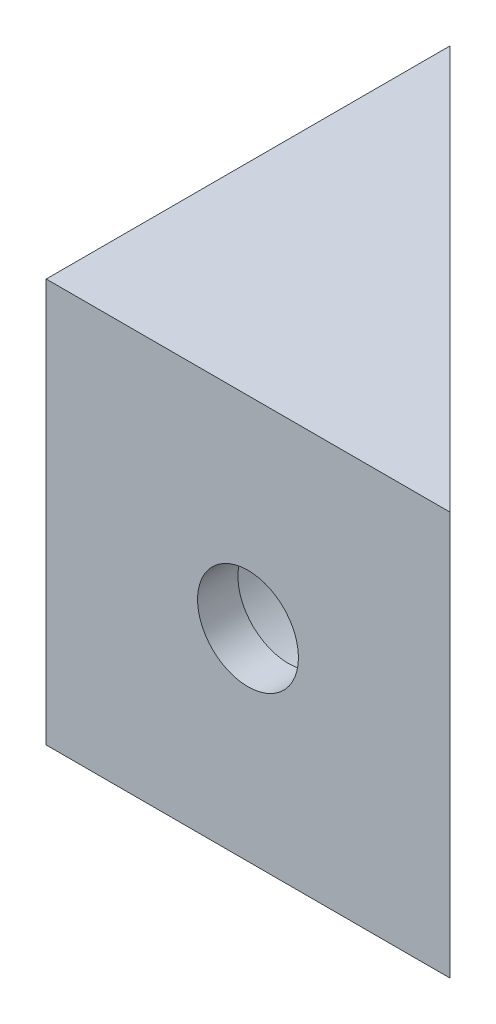
ISO-10303-21;
HEADER;
FILE_DESCRIPTION(('STEP AP214'),'2;1');
FILE_NAME('part.step','',(''),(''),'','','');
FILE_SCHEMA(('AUTOMOTIVE_DESIGN { 1 0 10303 214 1 1 1 1 }'));
ENDSEC;
DATA;
#1=APPLICATION_CONTEXT('core data for automotive mechanical design processes');
#2=APPLICATION_PROTOCOL_DEFINITION('international standard','automotive_design',2000,#1);
#3=PRODUCT_CONTEXT('',#1,'mechanical');
#4=PRODUCT('Part','Part','',(#3));
#5=PRODUCT_RELATED_PRODUCT_CATEGORY('part','',(#4));
#6=PRODUCT_DEFINITION_FORMATION('','',#4);
#7=PRODUCT_DEFINITION_CONTEXT('part definition',#1,'design');
#8=PRODUCT_DEFINITION('design','',#6,#7);
#9=PRODUCT_DEFINITION_SHAPE('','',#8);
#10=(LENGTH_UNIT() NAMED_UNIT(*) SI_UNIT(.MILLI.,.METRE.));
#11=(NAMED_UNIT(*) PLANE_ANGLE_UNIT() SI_UNIT($,.RADIAN.));
#12=(NAMED_UNIT(*) SI_UNIT($,.STERADIAN.) SOLID_ANGLE_UNIT());
#13=UNCERTAINTY_MEASURE_WITH_UNIT(LENGTH_MEASURE(1.E-05),#10,'distance_accuracy_value','');
#14=(GEOMETRIC_REPRESENTATION_CONTEXT(3) GLOBAL_UNCERTAINTY_ASSIGNED_CONTEXT((#13)) GLOBAL_UNIT_ASSIGNED_CONTEXT((#10,
#11,#12)) REPRESENTATION_CONTEXT('',''));
#15=CARTESIAN_POINT('',(0.,0.,0.));
#16=DIRECTION('',(0.,0.,1.));
#17=DIRECTION('',(1.,0.,0.));
#18=AXIS2_PLACEMENT_3D('',#15,#16,#17);
#19=CARTESIAN_POINT('',(20.,20.,0.));
#20=DIRECTION('',(0.,0.,-1.));
#21=DIRECTION('',(-1.,0.,0.));
#22=AXIS2_PLACEMENT_3D('',#19,#20,#21);
#23=PLANE('',#22);
#24=CARTESIAN_POINT('',(10.,10.,0.));
#25=DIRECTION('',(0.,0.,1.));
#26=DIRECTION('',(1.,0.,0.));
#27=AXIS2_PLACEMENT_3D('',#24,#25,#26);
#28=CIRCLE('',#27,2.5);
#29=CARTESIAN_POINT('',(12.5,10.,0.));
#30=VERTEX_POINT('',#29);
#31=EDGE_CURVE('E95',#30,#30,#28,.T.);
#32=ORIENTED_EDGE('',*,*,#31,.F.);
#33=EDGE_LOOP('',(#32));
#34=FACE_BOUND('',#33,.T.);
#35=DIRECTION('',(1.,0.,0.));
#36=VECTOR('',#35,1.);
#37=CARTESIAN_POINT('',(20.,0.,0.));
#38=LINE('',#37,#36);
#39=CARTESIAN_POINT('',(0.,0.,0.));
#40=VERTEX_POINT('',#39);
#41=CARTESIAN_POINT('',(20.,0.,0.));
#42=VERTEX_POINT('',#41);
#43=EDGE_CURVE('E103',#40,#42,#38,.T.);
#44=ORIENTED_EDGE('',*,*,#43,.T.);
#45=DIRECTION('',(0.,-1.,0.));
#46=VECTOR('',#45,1.);
#47=CARTESIAN_POINT('',(20.,20.,0.));
#48=LINE('',#47,#46);
#49=CARTESIAN_POINT('',(20.,20.,0.));
#50=VERTEX_POINT('',#49);
#51=EDGE_CURVE('E44',#50,#42,#48,.T.);
#52=ORIENTED_EDGE('',*,*,#51,.F.);
#53=DIRECTION('',(1.,0.,0.));
#54=VECTOR('',#53,1.);
#55=CARTESIAN_POINT('',(20.,20.,0.));
#56=LINE('',#55,#54);
#57=CARTESIAN_POINT('',(0.,20.,0.));
#58=VERTEX_POINT('',#57);
#59=EDGE_CURVE('E104',#58,#50,#56,.T.);
#60=ORIENTED_EDGE('',*,*,#59,.F.);
#61=DIRECTION('',(0.,-1.,0.));
#62=VECTOR('',#61,1.);
#63=CARTESIAN_POINT('',(0.,20.,0.));
#64=LINE('',#63,#62);
#65=EDGE_CURVE('E108',#58,#40,#64,.T.);
#66=ORIENTED_EDGE('',*,*,#65,.T.);
#67=EDGE_LOOP('',(#44,#52,#60,#66));
#68=FACE_BOUND('',#67,.T.);
#69=ADVANCED_FACE('F36',(#34,#68),#23,.F.);
#70=CARTESIAN_POINT('',(0.,20.,-20.));
#71=DIRECTION('',(-0.707106781186548,0.,0.707106781186548));
#72=DIRECTION('',(0.707106781186548,0.,0.707106781186548));
#73=AXIS2_PLACEMENT_3D('',#70,#71,#72);
#74=PLANE('',#73);
#75=CARTESIAN_POINT('',(10.,10.,-10.));
#76=DIRECTION('',(-0.707106781186548,0.,0.707106781186548));
#77=DIRECTION('',(-0.707106781186548,0.,-0.707106781186548));
#78=AXIS2_PLACEMENT_3D('',#75,#76,#77);
#79=ELLIPSE('',#78,7.07106781186532,4.99999999999989);
#80=CARTESIAN_POINT('',(10.,5.00000000000008,-10.));
#81=VERTEX_POINT('',#80);
#82=CARTESIAN_POINT('',(10.,14.9999999999999,-10.));
#83=VERTEX_POINT('',#82);
#84=EDGE_CURVE('E50',#81,#83,#79,.T.);
#85=ORIENTED_EDGE('',*,*,#84,.T.);
#86=EDGE_CURVE('E87',#83,#81,#79,.T.);
#87=ORIENTED_EDGE('',*,*,#86,.T.);
#88=EDGE_LOOP('',(#85,#87));
#89=FACE_BOUND('',#88,.T.);
#90=DIRECTION('',(-0.707106781186548,0.,-0.707106781186548));
#91=VECTOR('',#90,1.);
#92=CARTESIAN_POINT('',(0.,0.,-20.));
#93=LINE('',#92,#91);
#94=CARTESIAN_POINT('',(0.,0.,-20.));
#95=VERTEX_POINT('',#94);
#96=EDGE_CURVE('E111',#42,#95,#93,.T.);
#97=ORIENTED_EDGE('',*,*,#96,.T.);
#98=DIRECTION('',(0.,-1.,0.));
#99=VECTOR('',#98,1.);
#100=CARTESIAN_POINT('',(0.,20.,-20.));
#101=LINE('',#100,#99);
#102=CARTESIAN_POINT('',(0.,20.,-20.));
#103=VERTEX_POINT('',#102);
#104=EDGE_CURVE('E115',#103,#95,#101,.T.);
#105=ORIENTED_EDGE('',*,*,#104,.F.);
#106=DIRECTION('',(-0.707106781186548,0.,-0.707106781186548));
#107=VECTOR('',#106,1.);
#108=CARTESIAN_POINT('',(0.,20.,-20.));
#109=LINE('',#108,#107);
#110=EDGE_CURVE('E81',#50,#103,#109,.T.);
#111=ORIENTED_EDGE('',*,*,#110,.F.);
#112=ORIENTED_EDGE('',*,*,#51,.T.);
#113=EDGE_LOOP('',(#97,#105,#111,#112));
#114=FACE_BOUND('',#113,.T.);
#115=ADVANCED_FACE('F92',(#89,#114),#74,.F.);
#116=CARTESIAN_POINT('',(0.,20.,0.));
#117=DIRECTION('',(1.,0.,0.));
#118=DIRECTION('',(0.,0.,-1.));
#119=AXIS2_PLACEMENT_3D('',#116,#117,#118);
#120=PLANE('',#119);
#121=CARTESIAN_POINT('',(0.,10.,-10.));
#122=DIRECTION('',(-1.,0.,0.));
#123=DIRECTION('',(0.,0.,1.));
#124=AXIS2_PLACEMENT_3D('',#121,#122,#123);
#125=CIRCLE('',#124,2.5);
#126=CARTESIAN_POINT('',(0.,10.,-7.5));
#127=VERTEX_POINT('',#126);
#128=EDGE_CURVE('E93',#127,#127,#125,.T.);
#129=ORIENTED_EDGE('',*,*,#128,.F.);
#130=EDGE_LOOP('',(#129));
#131=FACE_BOUND('',#130,.T.);
#132=DIRECTION('',(0.,0.,1.));
#133=VECTOR('',#132,1.);
#134=CARTESIAN_POINT('',(0.,0.,0.));
#135=LINE('',#134,#133);
#136=EDGE_CURVE('E75',#95,#40,#135,.T.);
#137=ORIENTED_EDGE('',*,*,#136,.T.);
#138=ORIENTED_EDGE('',*,*,#65,.F.);
#139=DIRECTION('',(0.,0.,1.));
#140=VECTOR('',#139,1.);
#141=CARTESIAN_POINT('',(0.,20.,0.));
#142=LINE('',#141,#140);
#143=EDGE_CURVE('E58',#103,#58,#142,.T.);
#144=ORIENTED_EDGE('',*,*,#143,.F.);
#145=ORIENTED_EDGE('',*,*,#104,.T.);
#146=EDGE_LOOP('',(#137,#138,#144,#145));
#147=FACE_BOUND('',#146,.T.);
#148=ADVANCED_FACE('F149',(#131,#147),#120,.F.);
#149=CARTESIAN_POINT('',(0.,20.,0.));
#150=DIRECTION('',(0.,-1.,0.));
#151=DIRECTION('',(0.,0.,-1.));
#152=AXIS2_PLACEMENT_3D('',#149,#150,#151);
#153=PLANE('',#152);
#154=ORIENTED_EDGE('',*,*,#59,.T.);
#155=ORIENTED_EDGE('',*,*,#110,.T.);
#156=ORIENTED_EDGE('',*,*,#143,.T.);
#157=EDGE_LOOP('',(#154,#155,#156));
#158=FACE_BOUND('',#157,.T.);
#159=ADVANCED_FACE('F157',(#158),#153,.F.);
#160=CARTESIAN_POINT('',(0.,0.,0.));
#161=DIRECTION('',(0.,-1.,0.));
#162=DIRECTION('',(0.,0.,-1.));
#163=AXIS2_PLACEMENT_3D('',#160,#161,#162);
#164=PLANE('',#163);
#165=ORIENTED_EDGE('',*,*,#43,.F.);
#166=ORIENTED_EDGE('',*,*,#136,.F.);
#167=ORIENTED_EDGE('',*,*,#96,.F.);
#168=EDGE_LOOP('',(#165,#166,#167));
#169=FACE_BOUND('',#168,.T.);
#170=ADVANCED_FACE('F156',(#169),#164,.T.);
#171=CARTESIAN_POINT('',(10.,10.,-20.));
#172=DIRECTION('',(0.,0.,1.));
#173=DIRECTION('',(1.,0.,0.));
#174=AXIS2_PLACEMENT_3D('',#171,#172,#173);
#175=CYLINDRICAL_SURFACE('',#174,2.5);
#176=CARTESIAN_POINT('',(10.,10.,-2.));
#177=DIRECTION('',(0.,0.,1.));
#178=DIRECTION('',(1.,0.,0.));
#179=AXIS2_PLACEMENT_3D('',#176,#177,#178);
#180=CIRCLE('',#179,2.5);
#181=CARTESIAN_POINT('',(12.5,10.,-2.));
#182=VERTEX_POINT('',#181);
#183=EDGE_CURVE('E39',#182,#182,#180,.F.);
#184=ORIENTED_EDGE('',*,*,#183,.T.);
#185=EDGE_LOOP('',(#184));
#186=FACE_BOUND('',#185,.T.);
#187=ORIENTED_EDGE('',*,*,#31,.T.);
#188=EDGE_LOOP('',(#187));
#189=FACE_BOUND('',#188,.T.);
#190=ADVANCED_FACE('F164',(#186,#189),#175,.F.);
#191=CARTESIAN_POINT('',(20.,10.,-10.));
#192=DIRECTION('',(-1.,0.,0.));
#193=DIRECTION('',(0.,0.,1.));
#194=AXIS2_PLACEMENT_3D('',#191,#192,#193);
#195=CYLINDRICAL_SURFACE('',#194,2.5);
#196=CARTESIAN_POINT('',(2.,10.,-10.));
#197=DIRECTION('',(-1.,0.,0.));
#198=DIRECTION('',(0.,0.,1.));
#199=AXIS2_PLACEMENT_3D('',#196,#197,#198);
#200=CIRCLE('',#199,2.5);
#201=CARTESIAN_POINT('',(2.,10.,-7.5));
#202=VERTEX_POINT('',#201);
#203=EDGE_CURVE('E90',#202,#202,#200,.F.);
#204=ORIENTED_EDGE('',*,*,#203,.T.);
#205=EDGE_LOOP('',(#204));
#206=FACE_BOUND('',#205,.T.);
#207=ORIENTED_EDGE('',*,*,#128,.T.);
#208=EDGE_LOOP('',(#207));
#209=FACE_BOUND('',#208,.T.);
#210=ADVANCED_FACE('F171',(#206,#209),#195,.F.);
#211=CARTESIAN_POINT('',(20.,10.,-10.));
#212=DIRECTION('',(-1.,0.,0.));
#213=DIRECTION('',(0.,0.,1.));
#214=AXIS2_PLACEMENT_3D('',#211,#212,#213);
#215=CYLINDRICAL_SURFACE('',#214,4.99999999999989);
#216=CARTESIAN_POINT('',(2.,10.,-10.));
#217=DIRECTION('',(-1.,0.,0.));
#218=DIRECTION('',(0.,0.,1.));
#219=AXIS2_PLACEMENT_3D('',#216,#217,#218);
#220=CIRCLE('',#219,4.99999999999989);
#221=CARTESIAN_POINT('',(2.,10.,-5.0000000000001));
#222=VERTEX_POINT('',#221);
#223=EDGE_CURVE('E98',#222,#222,#220,.T.);
#224=ORIENTED_EDGE('',*,*,#223,.T.);
#225=EDGE_LOOP('',(#224));
#226=FACE_BOUND('',#225,.T.);
#227=ORIENTED_EDGE('',*,*,#86,.F.);
#228=CARTESIAN_POINT('',(10.,10.,-10.));
#229=DIRECTION('',(-0.707106781186547,0.,-0.707106781186547));
#230=DIRECTION('',(-0.707106781186547,0.,0.707106781186547));
#231=AXIS2_PLACEMENT_3D('',#228,#229,#230);
#232=ELLIPSE('',#231,7.0710678118654,4.99999999999995);
#233=EDGE_CURVE('E11',#83,#81,#232,.F.);
#234=ORIENTED_EDGE('',*,*,#233,.T.);
#235=EDGE_LOOP('',(#227,#234));
#236=FACE_BOUND('',#235,.T.);
#237=ADVANCED_FACE('F88',(#226,#236),#215,.F.);
#238=CARTESIAN_POINT('',(2.,10.,-10.));
#239=DIRECTION('',(-1.,0.,0.));
#240=DIRECTION('',(0.,0.,1.));
#241=AXIS2_PLACEMENT_3D('',#238,#239,#240);
#242=PLANE('',#241);
#243=ORIENTED_EDGE('',*,*,#223,.F.);
#244=EDGE_LOOP('',(#243));
#245=FACE_BOUND('',#244,.T.);
#246=ORIENTED_EDGE('',*,*,#203,.F.);
#247=EDGE_LOOP('',(#246));
#248=FACE_BOUND('',#247,.T.);
#249=ADVANCED_FACE('F135',(#245,#248),#242,.F.);
#250=CARTESIAN_POINT('',(10.,10.,-2.));
#251=DIRECTION('',(0.,0.,1.));
#252=DIRECTION('',(1.,0.,0.));
#253=AXIS2_PLACEMENT_3D('',#250,#251,#252);
#254=PLANE('',#253);
#255=CARTESIAN_POINT('',(10.,10.,-2.));
#256=DIRECTION('',(0.,0.,1.));
#257=DIRECTION('',(1.,0.,0.));
#258=AXIS2_PLACEMENT_3D('',#255,#256,#257);
#259=CIRCLE('',#258,5.);
#260=CARTESIAN_POINT('',(15.,10.,-2.));
#261=VERTEX_POINT('',#260);
#262=EDGE_CURVE('E125',#261,#261,#259,.T.);
#263=ORIENTED_EDGE('',*,*,#262,.F.);
#264=EDGE_LOOP('',(#263));
#265=FACE_BOUND('',#264,.T.);
#266=ORIENTED_EDGE('',*,*,#183,.F.);
#267=EDGE_LOOP('',(#266));
#268=FACE_BOUND('',#267,.T.);
#269=ADVANCED_FACE('F132',(#265,#268),#254,.F.);
#270=CARTESIAN_POINT('',(10.,10.,-22.));
#271=DIRECTION('',(0.,0.,1.));
#272=DIRECTION('',(1.,0.,0.));
#273=AXIS2_PLACEMENT_3D('',#270,#271,#272);
#274=CYLINDRICAL_SURFACE('',#273,5.);
#275=ORIENTED_EDGE('',*,*,#262,.T.);
#276=EDGE_LOOP('',(#275));
#277=FACE_BOUND('',#276,.T.);
#278=ORIENTED_EDGE('',*,*,#233,.F.);
#279=ORIENTED_EDGE('',*,*,#84,.F.);
#280=EDGE_LOOP('',(#278,#279));
#281=FACE_BOUND('',#280,.T.);
#282=ADVANCED_FACE('F84',(#277,#281),#274,.F.);
#283=CLOSED_SHELL('',(#69,#115,#148,#159,#170,#190,#210,#237,#249,#269,#282));
#284=MANIFOLD_SOLID_BREP('B2',#283);
#285=ADVANCED_BREP_SHAPE_REPRESENTATION('',(#18,#284),#14);
#286=SHAPE_DEFINITION_REPRESENTATION(#9,#285);
ENDSEC;
END-ISO-10303-21;
